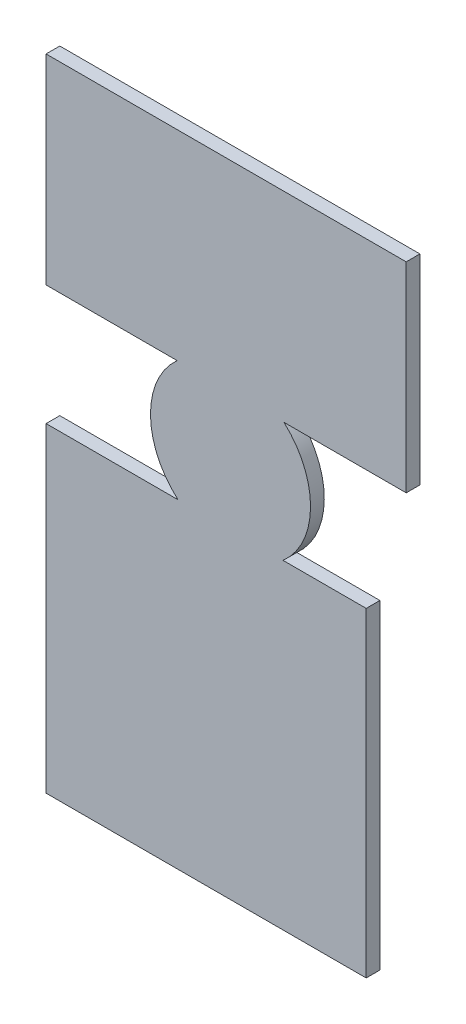
ISO-10303-21;
HEADER;
FILE_DESCRIPTION(('STEP AP214'),'2;1');
FILE_NAME('part.step','',(''),(''),'','','');
FILE_SCHEMA(('AUTOMOTIVE_DESIGN { 1 0 10303 214 1 1 1 1 }'));
ENDSEC;
DATA;
#1=APPLICATION_CONTEXT('core data for automotive mechanical design processes');
#2=APPLICATION_PROTOCOL_DEFINITION('international standard','automotive_design',2000,#1);
#3=PRODUCT_CONTEXT('',#1,'mechanical');
#4=PRODUCT('Part','Part','',(#3));
#5=PRODUCT_RELATED_PRODUCT_CATEGORY('part','',(#4));
#6=PRODUCT_DEFINITION_FORMATION('','',#4);
#7=PRODUCT_DEFINITION_CONTEXT('part definition',#1,'design');
#8=PRODUCT_DEFINITION('design','',#6,#7);
#9=PRODUCT_DEFINITION_SHAPE('','',#8);
#10=(LENGTH_UNIT() NAMED_UNIT(*) SI_UNIT(.MILLI.,.METRE.));
#11=(NAMED_UNIT(*) PLANE_ANGLE_UNIT() SI_UNIT($,.RADIAN.));
#12=(NAMED_UNIT(*) SI_UNIT($,.STERADIAN.) SOLID_ANGLE_UNIT());
#13=UNCERTAINTY_MEASURE_WITH_UNIT(LENGTH_MEASURE(1.E-05),#10,'distance_accuracy_value','');
#14=(GEOMETRIC_REPRESENTATION_CONTEXT(3) GLOBAL_UNCERTAINTY_ASSIGNED_CONTEXT((#13)) GLOBAL_UNIT_ASSIGNED_CONTEXT((#10,
#11,#12)) REPRESENTATION_CONTEXT('',''));
#15=CARTESIAN_POINT('',(0.,0.,0.));
#16=DIRECTION('',(0.,0.,1.));
#17=DIRECTION('',(1.,0.,0.));
#18=AXIS2_PLACEMENT_3D('',#15,#16,#17);
#19=CARTESIAN_POINT('',(0.674325206011,1.095777037693,0.));
#20=DIRECTION('',(0.,0.,-1.));
#21=DIRECTION('',(-1.,0.,0.));
#22=AXIS2_PLACEMENT_3D('',#19,#20,#21);
#23=PLANE('',#22);
#24=DIRECTION('',(1.,0.,0.));
#25=VECTOR('',#24,1.);
#26=CARTESIAN_POINT('',(0.25008,1.85,0.));
#27=LINE('',#26,#25);
#28=CARTESIAN_POINT('',(0.25008,1.85,0.));
#29=VERTEX_POINT('',#28);
#30=CARTESIAN_POINT('',(1.15008,1.85,0.));
#31=VERTEX_POINT('',#30);
#32=EDGE_CURVE('E89',#29,#31,#27,.T.);
#33=ORIENTED_EDGE('',*,*,#32,.T.);
#34=DIRECTION('',(0.,1.,0.));
#35=VECTOR('',#34,1.);
#36=CARTESIAN_POINT('',(1.15008,1.85,0.));
#37=LINE('',#36,#35);
#38=CARTESIAN_POINT('',(1.15008,1.35,0.));
#39=VERTEX_POINT('',#38);
#40=EDGE_CURVE('E91',#31,#39,#37,.F.);
#41=ORIENTED_EDGE('',*,*,#40,.T.);
#42=DIRECTION('',(-1.,-3.271928990576E-09,0.));
#43=VECTOR('',#42,1.);
#44=CARTESIAN_POINT('',(1.15008,1.35,0.));
#45=LINE('',#44,#43);
#46=CARTESIAN_POINT('',(0.84444986999961,1.34999999899987,0.));
#47=VERTEX_POINT('',#46);
#48=EDGE_CURVE('E94',#39,#47,#45,.T.);
#49=ORIENTED_EDGE('',*,*,#48,.T.);
#50=CARTESIAN_POINT('',(0.711,1.201,0.));
#51=DIRECTION('',(0.,0.,1.));
#52=DIRECTION('',(1.,0.,0.));
#53=AXIS2_PLACEMENT_3D('',#50,#51,#52);
#54=CIRCLE('',#53,0.200024667241);
#55=CARTESIAN_POINT('',(0.842182573644899,1.05000000040803,0.));
#56=VERTEX_POINT('',#55);
#57=EDGE_CURVE('E169',#56,#47,#54,.T.);
#58=ORIENTED_EDGE('',*,*,#57,.F.);
#59=DIRECTION('',(1.,-1.962836659912E-09,0.));
#60=VECTOR('',#59,1.);
#61=CARTESIAN_POINT('',(0.842182573645,1.050000000408,0.));
#62=LINE('',#61,#60);
#63=CARTESIAN_POINT('',(1.05008,1.04999999999993,0.));
#64=VERTEX_POINT('',#63);
#65=EDGE_CURVE('E123',#56,#64,#62,.T.);
#66=ORIENTED_EDGE('',*,*,#65,.T.);
#67=DIRECTION('',(0.,1.,0.));
#68=VECTOR('',#67,1.);
#69=CARTESIAN_POINT('',(1.05008,1.05,0.));
#70=LINE('',#69,#68);
#71=CARTESIAN_POINT('',(1.05008,0.25,0.));
#72=VERTEX_POINT('',#71);
#73=EDGE_CURVE('E130',#64,#72,#70,.F.);
#74=ORIENTED_EDGE('',*,*,#73,.T.);
#75=DIRECTION('',(1.,0.,0.));
#76=VECTOR('',#75,1.);
#77=CARTESIAN_POINT('',(1.05008,0.25,0.));
#78=LINE('',#77,#76);
#79=CARTESIAN_POINT('',(0.25008,0.25,0.));
#80=VERTEX_POINT('',#79);
#81=EDGE_CURVE('E136',#72,#80,#78,.F.);
#82=ORIENTED_EDGE('',*,*,#81,.T.);
#83=DIRECTION('',(0.,1.,0.));
#84=VECTOR('',#83,1.);
#85=CARTESIAN_POINT('',(0.25008,0.25,0.));
#86=LINE('',#85,#84);
#87=CARTESIAN_POINT('',(0.25008,1.05,0.));
#88=VERTEX_POINT('',#87);
#89=EDGE_CURVE('E142',#80,#88,#86,.T.);
#90=ORIENTED_EDGE('',*,*,#89,.T.);
#91=DIRECTION('',(1.,-3.032716330705E-09,0.));
#92=VECTOR('',#91,1.);
#93=CARTESIAN_POINT('',(0.25008,1.05,0.));
#94=LINE('',#93,#92);
#95=CARTESIAN_POINT('',(0.57981742800012,1.049999999,0.));
#96=VERTEX_POINT('',#95);
#97=EDGE_CURVE('E148',#88,#96,#94,.T.);
#98=ORIENTED_EDGE('',*,*,#97,.T.);
#99=CARTESIAN_POINT('',(0.711,1.201,0.));
#100=DIRECTION('',(0.,0.,1.));
#101=DIRECTION('',(1.,0.,0.));
#102=AXIS2_PLACEMENT_3D('',#99,#100,#101);
#103=CIRCLE('',#102,0.200024667225);
#104=CARTESIAN_POINT('',(0.577550131617857,1.35000000042705,0.));
#105=VERTEX_POINT('',#104);
#106=EDGE_CURVE('E20',#105,#96,#103,.T.);
#107=ORIENTED_EDGE('',*,*,#106,.F.);
#108=DIRECTION('',(-1.,-1.303932296326E-09,0.));
#109=VECTOR('',#108,1.);
#110=CARTESIAN_POINT('',(0.577550131618,1.350000000427,0.));
#111=LINE('',#110,#109);
#112=CARTESIAN_POINT('',(0.25008,1.35,0.));
#113=VERTEX_POINT('',#112);
#114=EDGE_CURVE('E67',#105,#113,#111,.T.);
#115=ORIENTED_EDGE('',*,*,#114,.T.);
#116=DIRECTION('',(0.,1.,0.));
#117=VECTOR('',#116,1.);
#118=CARTESIAN_POINT('',(0.25008,1.35,0.));
#119=LINE('',#118,#117);
#120=EDGE_CURVE('E157',#113,#29,#119,.T.);
#121=ORIENTED_EDGE('',*,*,#120,.T.);
#122=EDGE_LOOP('',(#33,#41,#49,#58,#66,#74,#82,#90,#98,#107,#115,#121));
#123=FACE_BOUND('',#122,.T.);
#124=ADVANCED_FACE('F17',(#123),#23,.T.);
#125=CARTESIAN_POINT('',(1.15008,1.35,0.));
#126=DIRECTION('',(-3.271928990576E-09,1.,0.));
#127=DIRECTION('',(-1.,-3.271928990576E-09,0.));
#128=AXIS2_PLACEMENT_3D('',#125,#126,#127);
#129=PLANE('',#128);
#130=DIRECTION('',(0.,0.,1.));
#131=VECTOR('',#130,1.);
#132=CARTESIAN_POINT('',(0.84444986999976,1.34999999899973,0.));
#133=LINE('',#132,#131);
#134=CARTESIAN_POINT('',(0.84444986999961,1.34999999899987,0.03429));
#135=VERTEX_POINT('',#134);
#136=EDGE_CURVE('E105',#47,#135,#133,.T.);
#137=ORIENTED_EDGE('',*,*,#136,.F.);
#138=ORIENTED_EDGE('',*,*,#48,.F.);
#139=DIRECTION('',(0.,0.,1.));
#140=VECTOR('',#139,1.);
#141=CARTESIAN_POINT('',(1.15008,1.35,0.));
#142=LINE('',#141,#140);
#143=CARTESIAN_POINT('',(1.15008,1.34999999933333,0.03429));
#144=VERTEX_POINT('',#143);
#145=EDGE_CURVE('E99',#39,#144,#142,.T.);
#146=ORIENTED_EDGE('',*,*,#145,.T.);
#147=DIRECTION('',(1.,0.,0.));
#148=VECTOR('',#147,1.);
#149=CARTESIAN_POINT('',(0.674325206011,1.349999999,0.03429));
#150=LINE('',#149,#148);
#151=EDGE_CURVE('E171',#135,#144,#150,.T.);
#152=ORIENTED_EDGE('',*,*,#151,.F.);
#153=EDGE_LOOP('',(#137,#138,#146,#152));
#154=FACE_BOUND('',#153,.T.);
#155=ADVANCED_FACE('F102',(#154),#129,.F.);
#156=CARTESIAN_POINT('',(1.15008,1.85,0.));
#157=DIRECTION('',(-1.,0.,0.));
#158=DIRECTION('',(0.,0.,1.));
#159=AXIS2_PLACEMENT_3D('',#156,#157,#158);
#160=PLANE('',#159);
#161=ORIENTED_EDGE('',*,*,#145,.F.);
#162=ORIENTED_EDGE('',*,*,#40,.F.);
#163=DIRECTION('',(0.,0.,-1.));
#164=VECTOR('',#163,1.);
#165=CARTESIAN_POINT('',(1.15008,1.85,0.));
#166=LINE('',#165,#164);
#167=CARTESIAN_POINT('',(1.15008,1.85,0.03429));
#168=VERTEX_POINT('',#167);
#169=EDGE_CURVE('E113',#31,#168,#166,.F.);
#170=ORIENTED_EDGE('',*,*,#169,.T.);
#171=DIRECTION('',(0.,1.,0.));
#172=VECTOR('',#171,1.);
#173=CARTESIAN_POINT('',(1.15008,1.095777037693,0.03429));
#174=LINE('',#173,#172);
#175=EDGE_CURVE('E110',#144,#168,#174,.T.);
#176=ORIENTED_EDGE('',*,*,#175,.F.);
#177=EDGE_LOOP('',(#161,#162,#170,#176));
#178=FACE_BOUND('',#177,.T.);
#179=ADVANCED_FACE('F108',(#178),#160,.F.);
#180=CARTESIAN_POINT('',(0.25008,1.85,0.));
#181=DIRECTION('',(0.,-1.,0.));
#182=DIRECTION('',(0.,0.,-1.));
#183=AXIS2_PLACEMENT_3D('',#180,#181,#182);
#184=PLANE('',#183);
#185=ORIENTED_EDGE('',*,*,#169,.F.);
#186=ORIENTED_EDGE('',*,*,#32,.F.);
#187=DIRECTION('',(0.,0.,-1.));
#188=VECTOR('',#187,1.);
#189=CARTESIAN_POINT('',(0.25008,1.85,0.));
#190=LINE('',#189,#188);
#191=CARTESIAN_POINT('',(0.25008,1.85,0.03429));
#192=VERTEX_POINT('',#191);
#193=EDGE_CURVE('E154',#29,#192,#190,.F.);
#194=ORIENTED_EDGE('',*,*,#193,.T.);
#195=DIRECTION('',(1.,0.,0.));
#196=VECTOR('',#195,1.);
#197=CARTESIAN_POINT('',(0.674325206011,1.85,0.03429));
#198=LINE('',#197,#196);
#199=EDGE_CURVE('E217',#168,#192,#198,.F.);
#200=ORIENTED_EDGE('',*,*,#199,.F.);
#201=EDGE_LOOP('',(#185,#186,#194,#200));
#202=FACE_BOUND('',#201,.T.);
#203=ADVANCED_FACE('F279',(#202),#184,.F.);
#204=CARTESIAN_POINT('',(0.25008,1.35,0.));
#205=DIRECTION('',(1.,0.,0.));
#206=DIRECTION('',(0.,0.,-1.));
#207=AXIS2_PLACEMENT_3D('',#204,#205,#206);
#208=PLANE('',#207);
#209=ORIENTED_EDGE('',*,*,#193,.F.);
#210=ORIENTED_EDGE('',*,*,#120,.F.);
#211=DIRECTION('',(0.,0.,1.));
#212=VECTOR('',#211,1.);
#213=CARTESIAN_POINT('',(0.25008,1.35,0.));
#214=LINE('',#213,#212);
#215=CARTESIAN_POINT('',(0.25008,1.35,0.03429));
#216=VERTEX_POINT('',#215);
#217=EDGE_CURVE('E153',#113,#216,#214,.T.);
#218=ORIENTED_EDGE('',*,*,#217,.T.);
#219=DIRECTION('',(0.,1.,0.));
#220=VECTOR('',#219,1.);
#221=CARTESIAN_POINT('',(0.25008,1.095777037693,0.03429));
#222=LINE('',#221,#220);
#223=EDGE_CURVE('E214',#192,#216,#222,.F.);
#224=ORIENTED_EDGE('',*,*,#223,.F.);
#225=EDGE_LOOP('',(#209,#210,#218,#224));
#226=FACE_BOUND('',#225,.T.);
#227=ADVANCED_FACE('F280',(#226),#208,.F.);
#228=CARTESIAN_POINT('',(0.577550131618,1.350000000427,0.));
#229=DIRECTION('',(-1.303932296326E-09,1.,0.));
#230=DIRECTION('',(-1.,-1.303932296326E-09,0.));
#231=AXIS2_PLACEMENT_3D('',#228,#229,#230);
#232=PLANE('',#231);
#233=ORIENTED_EDGE('',*,*,#217,.F.);
#234=ORIENTED_EDGE('',*,*,#114,.F.);
#235=DIRECTION('',(0.,0.,1.));
#236=VECTOR('',#235,1.);
#237=CARTESIAN_POINT('',(0.577550131617912,1.3500000004271,0.));
#238=LINE('',#237,#236);
#239=CARTESIAN_POINT('',(0.577550131379479,1.35000000021355,0.03429));
#240=VERTEX_POINT('',#239);
#241=EDGE_CURVE('E207',#240,#105,#238,.F.);
#242=ORIENTED_EDGE('',*,*,#241,.F.);
#243=DIRECTION('',(1.,0.,0.));
#244=VECTOR('',#243,1.);
#245=CARTESIAN_POINT('',(0.674325206011,1.35,0.03429));
#246=LINE('',#245,#244);
#247=EDGE_CURVE('E168',#216,#240,#246,.T.);
#248=ORIENTED_EDGE('',*,*,#247,.F.);
#249=EDGE_LOOP('',(#233,#234,#242,#248));
#250=FACE_BOUND('',#249,.T.);
#251=ADVANCED_FACE('F282',(#250),#232,.F.);
#252=CARTESIAN_POINT('',(0.711,1.201,0.));
#253=DIRECTION('',(0.,0.,1.));
#254=DIRECTION('',(1.,0.,0.));
#255=AXIS2_PLACEMENT_3D('',#252,#253,#254);
#256=CYLINDRICAL_SURFACE('',#255,0.200024667225);
#257=ORIENTED_EDGE('',*,*,#106,.T.);
#258=DIRECTION('',(0.,0.,1.));
#259=VECTOR('',#258,1.);
#260=CARTESIAN_POINT('',(0.579817428,1.049999999,0.));
#261=LINE('',#260,#259);
#262=CARTESIAN_POINT('',(0.57981742800012,1.049999999,0.03429));
#263=VERTEX_POINT('',#262);
#264=EDGE_CURVE('E145',#96,#263,#261,.T.);
#265=ORIENTED_EDGE('',*,*,#264,.T.);
#266=CARTESIAN_POINT('',(0.711,1.201,0.03429));
#267=DIRECTION('',(0.,0.,1.));
#268=DIRECTION('',(1.,0.,0.));
#269=AXIS2_PLACEMENT_3D('',#266,#267,#268);
#270=CIRCLE('',#269,0.200024667225);
#271=EDGE_CURVE('E165',#240,#263,#270,.T.);
#272=ORIENTED_EDGE('',*,*,#271,.F.);
#273=ORIENTED_EDGE('',*,*,#241,.T.);
#274=EDGE_LOOP('',(#257,#265,#272,#273));
#275=FACE_BOUND('',#274,.T.);
#276=ADVANCED_FACE('F285',(#275),#256,.T.);
#277=CARTESIAN_POINT('',(0.25008,1.05,0.));
#278=DIRECTION('',(-3.032716330705E-09,-1.,0.));
#279=DIRECTION('',(1.,-3.032716330705E-09,0.));
#280=AXIS2_PLACEMENT_3D('',#277,#278,#279);
#281=PLANE('',#280);
#282=ORIENTED_EDGE('',*,*,#264,.F.);
#283=ORIENTED_EDGE('',*,*,#97,.F.);
#284=DIRECTION('',(0.,0.,-1.));
#285=VECTOR('',#284,1.);
#286=CARTESIAN_POINT('',(0.25008,1.05,0.));
#287=LINE('',#286,#285);
#288=CARTESIAN_POINT('',(0.25008,1.04999999933333,0.03429));
#289=VERTEX_POINT('',#288);
#290=EDGE_CURVE('E139',#88,#289,#287,.F.);
#291=ORIENTED_EDGE('',*,*,#290,.T.);
#292=DIRECTION('',(1.,0.,0.));
#293=VECTOR('',#292,1.);
#294=CARTESIAN_POINT('',(0.674325206011,1.049999999,0.03429));
#295=LINE('',#294,#293);
#296=EDGE_CURVE('E167',#263,#289,#295,.F.);
#297=ORIENTED_EDGE('',*,*,#296,.F.);
#298=EDGE_LOOP('',(#282,#283,#291,#297));
#299=FACE_BOUND('',#298,.T.);
#300=ADVANCED_FACE('F290',(#299),#281,.F.);
#301=CARTESIAN_POINT('',(0.25008,0.25,0.));
#302=DIRECTION('',(1.,0.,0.));
#303=DIRECTION('',(0.,0.,-1.));
#304=AXIS2_PLACEMENT_3D('',#301,#302,#303);
#305=PLANE('',#304);
#306=ORIENTED_EDGE('',*,*,#290,.F.);
#307=ORIENTED_EDGE('',*,*,#89,.F.);
#308=DIRECTION('',(0.,0.,1.));
#309=VECTOR('',#308,1.);
#310=CARTESIAN_POINT('',(0.25008,0.25,0.));
#311=LINE('',#310,#309);
#312=CARTESIAN_POINT('',(0.25008,0.25,0.03429));
#313=VERTEX_POINT('',#312);
#314=EDGE_CURVE('E133',#80,#313,#311,.T.);
#315=ORIENTED_EDGE('',*,*,#314,.T.);
#316=DIRECTION('',(0.,1.,0.));
#317=VECTOR('',#316,1.);
#318=CARTESIAN_POINT('',(0.25008,1.095777037693,0.03429));
#319=LINE('',#318,#317);
#320=EDGE_CURVE('E191',#289,#313,#319,.F.);
#321=ORIENTED_EDGE('',*,*,#320,.F.);
#322=EDGE_LOOP('',(#306,#307,#315,#321));
#323=FACE_BOUND('',#322,.T.);
#324=ADVANCED_FACE('F268',(#323),#305,.F.);
#325=CARTESIAN_POINT('',(1.05008,0.25,0.));
#326=DIRECTION('',(0.,1.,0.));
#327=DIRECTION('',(0.,0.,1.));
#328=AXIS2_PLACEMENT_3D('',#325,#326,#327);
#329=PLANE('',#328);
#330=ORIENTED_EDGE('',*,*,#314,.F.);
#331=ORIENTED_EDGE('',*,*,#81,.F.);
#332=DIRECTION('',(0.,0.,1.));
#333=VECTOR('',#332,1.);
#334=CARTESIAN_POINT('',(1.05008,0.25,0.));
#335=LINE('',#334,#333);
#336=CARTESIAN_POINT('',(1.05008,0.25,0.03429));
#337=VERTEX_POINT('',#336);
#338=EDGE_CURVE('E127',#72,#337,#335,.T.);
#339=ORIENTED_EDGE('',*,*,#338,.T.);
#340=DIRECTION('',(1.,0.,0.));
#341=VECTOR('',#340,1.);
#342=CARTESIAN_POINT('',(0.674325206011,0.25,0.03429));
#343=LINE('',#342,#341);
#344=EDGE_CURVE('E182',#313,#337,#343,.T.);
#345=ORIENTED_EDGE('',*,*,#344,.F.);
#346=EDGE_LOOP('',(#330,#331,#339,#345));
#347=FACE_BOUND('',#346,.T.);
#348=ADVANCED_FACE('F261',(#347),#329,.F.);
#349=CARTESIAN_POINT('',(1.05008,1.05,0.));
#350=DIRECTION('',(-1.,0.,0.));
#351=DIRECTION('',(0.,0.,1.));
#352=AXIS2_PLACEMENT_3D('',#349,#350,#351);
#353=PLANE('',#352);
#354=ORIENTED_EDGE('',*,*,#338,.F.);
#355=ORIENTED_EDGE('',*,*,#73,.F.);
#356=DIRECTION('',(0.,0.,1.));
#357=VECTOR('',#356,1.);
#358=CARTESIAN_POINT('',(1.05008,1.04999999999993,0.));
#359=LINE('',#358,#357);
#360=CARTESIAN_POINT('',(1.05008,1.04999999999998,0.03429));
#361=VERTEX_POINT('',#360);
#362=EDGE_CURVE('E126',#64,#361,#359,.T.);
#363=ORIENTED_EDGE('',*,*,#362,.T.);
#364=DIRECTION('',(0.,1.,0.));
#365=VECTOR('',#364,1.);
#366=CARTESIAN_POINT('',(1.05008,1.095777037693,0.03429));
#367=LINE('',#366,#365);
#368=EDGE_CURVE('E179',#337,#361,#367,.T.);
#369=ORIENTED_EDGE('',*,*,#368,.F.);
#370=EDGE_LOOP('',(#354,#355,#363,#369));
#371=FACE_BOUND('',#370,.T.);
#372=ADVANCED_FACE('F254',(#371),#353,.F.);
#373=CARTESIAN_POINT('',(0.842182573645,1.050000000408,0.));
#374=DIRECTION('',(-1.962836659912E-09,-1.,0.));
#375=DIRECTION('',(1.,-1.962836659912E-09,0.));
#376=AXIS2_PLACEMENT_3D('',#373,#374,#375);
#377=PLANE('',#376);
#378=ORIENTED_EDGE('',*,*,#362,.F.);
#379=ORIENTED_EDGE('',*,*,#65,.F.);
#380=DIRECTION('',(0.,0.,1.));
#381=VECTOR('',#380,1.);
#382=CARTESIAN_POINT('',(0.842182573644939,1.05000000040807,0.));
#383=LINE('',#382,#381);
#384=CARTESIAN_POINT('',(0.842182573410081,1.05000000020404,0.03429));
#385=VERTEX_POINT('',#384);
#386=EDGE_CURVE('E35',#385,#56,#383,.F.);
#387=ORIENTED_EDGE('',*,*,#386,.F.);
#388=DIRECTION('',(1.,0.,0.));
#389=VECTOR('',#388,1.);
#390=CARTESIAN_POINT('',(0.674325206011,1.05,0.03429));
#391=LINE('',#390,#389);
#392=EDGE_CURVE('E26',#361,#385,#391,.F.);
#393=ORIENTED_EDGE('',*,*,#392,.F.);
#394=EDGE_LOOP('',(#378,#379,#387,#393));
#395=FACE_BOUND('',#394,.T.);
#396=ADVANCED_FACE('F248',(#395),#377,.F.);
#397=CARTESIAN_POINT('',(0.711,1.201,0.));
#398=DIRECTION('',(0.,0.,1.));
#399=DIRECTION('',(1.,0.,0.));
#400=AXIS2_PLACEMENT_3D('',#397,#398,#399);
#401=CYLINDRICAL_SURFACE('',#400,0.200024667241);
#402=ORIENTED_EDGE('',*,*,#57,.T.);
#403=ORIENTED_EDGE('',*,*,#136,.T.);
#404=CARTESIAN_POINT('',(0.711,1.201,0.03429));
#405=DIRECTION('',(0.,0.,1.));
#406=DIRECTION('',(1.,0.,0.));
#407=AXIS2_PLACEMENT_3D('',#404,#405,#406);
#408=CIRCLE('',#407,0.200024667241);
#409=EDGE_CURVE('E11',#385,#135,#408,.T.);
#410=ORIENTED_EDGE('',*,*,#409,.F.);
#411=ORIENTED_EDGE('',*,*,#386,.T.);
#412=EDGE_LOOP('',(#402,#403,#410,#411));
#413=FACE_BOUND('',#412,.T.);
#414=ADVANCED_FACE('F301',(#413),#401,.T.);
#415=CARTESIAN_POINT('',(0.674325206011,1.095777037693,0.03429));
#416=DIRECTION('',(0.,0.,1.));
#417=DIRECTION('',(1.,0.,0.));
#418=AXIS2_PLACEMENT_3D('',#415,#416,#417);
#419=PLANE('',#418);
#420=ORIENTED_EDGE('',*,*,#392,.T.);
#421=ORIENTED_EDGE('',*,*,#409,.T.);
#422=ORIENTED_EDGE('',*,*,#151,.T.);
#423=ORIENTED_EDGE('',*,*,#175,.T.);
#424=ORIENTED_EDGE('',*,*,#199,.T.);
#425=ORIENTED_EDGE('',*,*,#223,.T.);
#426=ORIENTED_EDGE('',*,*,#247,.T.);
#427=ORIENTED_EDGE('',*,*,#271,.T.);
#428=ORIENTED_EDGE('',*,*,#296,.T.);
#429=ORIENTED_EDGE('',*,*,#320,.T.);
#430=ORIENTED_EDGE('',*,*,#344,.T.);
#431=ORIENTED_EDGE('',*,*,#368,.T.);
#432=EDGE_LOOP('',(#420,#421,#422,#423,#424,#425,#426,#427,#428,#429,#430,#431));
#433=FACE_BOUND('',#432,.T.);
#434=ADVANCED_FACE('F245',(#433),#419,.T.);
#435=CLOSED_SHELL('',(#124,#155,#179,#203,#227,#251,#276,#300,#324,#348,#372,#396,#414,#434));
#436=MANIFOLD_SOLID_BREP('B1',#435);
#437=ADVANCED_BREP_SHAPE_REPRESENTATION('',(#18,#436),#14);
#438=SHAPE_DEFINITION_REPRESENTATION(#9,#437);
ENDSEC;
END-ISO-10303-21;
